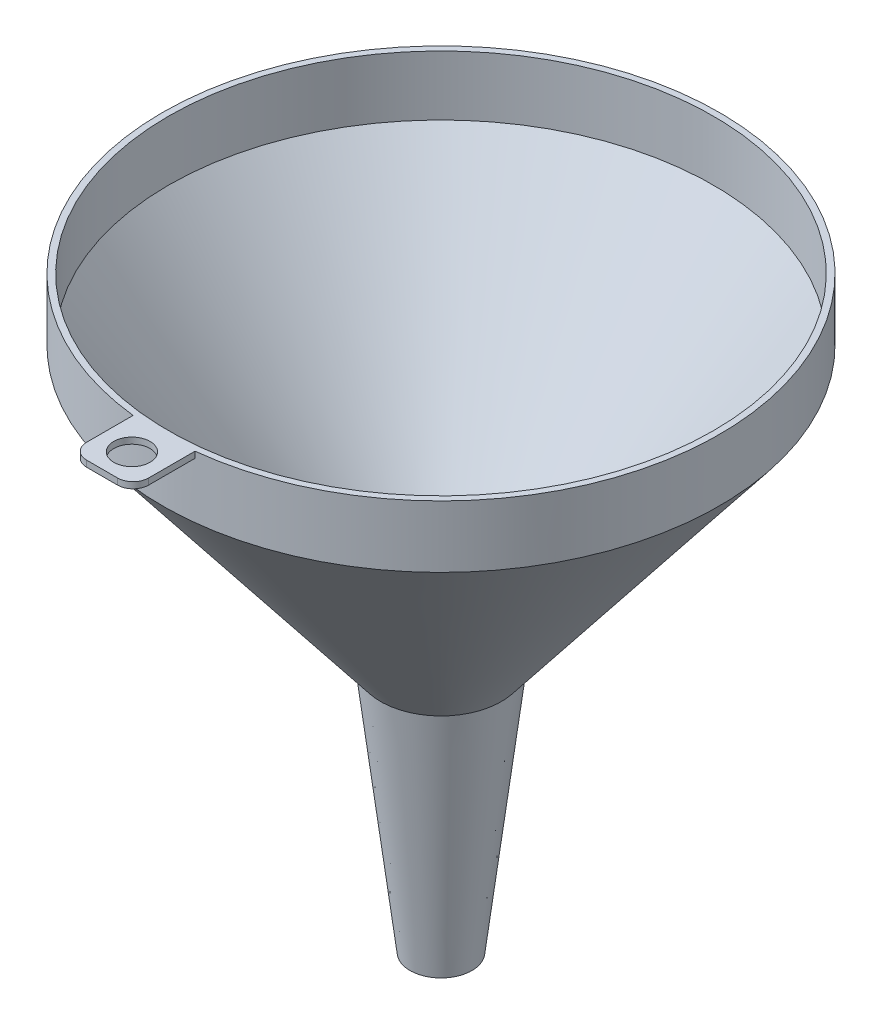
ISO-10303-21;
HEADER;
FILE_DESCRIPTION(('STEP AP214'),'2;1');
FILE_NAME('part.step','',(''),(''),'','','');
FILE_SCHEMA(('AUTOMOTIVE_DESIGN { 1 0 10303 214 1 1 1 1 }'));
ENDSEC;
DATA;
#1=APPLICATION_CONTEXT('core data for automotive mechanical design processes');
#2=APPLICATION_PROTOCOL_DEFINITION('international standard','automotive_design',2000,#1);
#3=PRODUCT_CONTEXT('',#1,'mechanical');
#4=PRODUCT('Part','Part','',(#3));
#5=PRODUCT_RELATED_PRODUCT_CATEGORY('part','',(#4));
#6=PRODUCT_DEFINITION_FORMATION('','',#4);
#7=PRODUCT_DEFINITION_CONTEXT('part definition',#1,'design');
#8=PRODUCT_DEFINITION('design','',#6,#7);
#9=PRODUCT_DEFINITION_SHAPE('','',#8);
#10=(LENGTH_UNIT() NAMED_UNIT(*) SI_UNIT(.MILLI.,.METRE.));
#11=(NAMED_UNIT(*) PLANE_ANGLE_UNIT() SI_UNIT($,.RADIAN.));
#12=(NAMED_UNIT(*) SI_UNIT($,.STERADIAN.) SOLID_ANGLE_UNIT());
#13=UNCERTAINTY_MEASURE_WITH_UNIT(LENGTH_MEASURE(1.E-05),#10,'distance_accuracy_value','');
#14=(GEOMETRIC_REPRESENTATION_CONTEXT(3) GLOBAL_UNCERTAINTY_ASSIGNED_CONTEXT((#13)) GLOBAL_UNIT_ASSIGNED_CONTEXT((#10,
#11,#12)) REPRESENTATION_CONTEXT('',''));
#15=CARTESIAN_POINT('',(0.,0.,0.));
#16=DIRECTION('',(0.,0.,1.));
#17=DIRECTION('',(1.,0.,0.));
#18=AXIS2_PLACEMENT_3D('',#15,#16,#17);
#19=CARTESIAN_POINT('',(0.,95.,0.));
#20=DIRECTION('',(0.,1.,0.));
#21=DIRECTION('',(-1.,0.,0.));
#22=AXIS2_PLACEMENT_3D('',#19,#20,#21);
#23=CYLINDRICAL_SURFACE('',#22,90.);
#24=CARTESIAN_POINT('',(0.,75.,0.));
#25=DIRECTION('',(0.,1.,0.));
#26=DIRECTION('',(-1.,0.,0.));
#27=AXIS2_PLACEMENT_3D('',#24,#25,#26);
#28=CIRCLE('',#27,90.);
#29=CARTESIAN_POINT('',(-90.,75.,0.));
#30=VERTEX_POINT('',#29);
#31=EDGE_CURVE('E137',#30,#30,#28,.T.);
#32=ORIENTED_EDGE('',*,*,#31,.T.);
#33=EDGE_LOOP('',(#32));
#34=FACE_BOUND('',#33,.T.);
#35=DIRECTION('',(0.,1.,0.));
#36=VECTOR('',#35,1.);
#37=CARTESIAN_POINT('',(10.,93.,89.4427190999916));
#38=LINE('',#37,#36);
#39=CARTESIAN_POINT('',(10.,93.,89.4427190999916));
#40=VERTEX_POINT('',#39);
#41=CARTESIAN_POINT('',(10.,95.,89.4427190999916));
#42=VERTEX_POINT('',#41);
#43=EDGE_CURVE('E100',#40,#42,#38,.T.);
#44=ORIENTED_EDGE('',*,*,#43,.F.);
#45=CARTESIAN_POINT('',(0.,93.,0.));
#46=DIRECTION('',(0.,1.,0.));
#47=DIRECTION('',(0.,0.,1.));
#48=AXIS2_PLACEMENT_3D('',#45,#46,#47);
#49=CIRCLE('',#48,90.);
#50=CARTESIAN_POINT('',(-9.99999999999999,93.,89.4427190999916));
#51=VERTEX_POINT('',#50);
#52=EDGE_CURVE('E105',#51,#40,#49,.T.);
#53=ORIENTED_EDGE('',*,*,#52,.F.);
#54=DIRECTION('',(0.,1.,0.));
#55=VECTOR('',#54,1.);
#56=CARTESIAN_POINT('',(-9.99999999999999,93.,89.4427190999916));
#57=LINE('',#56,#55);
#58=CARTESIAN_POINT('',(-9.99999999999999,95.,89.4427190999916));
#59=VERTEX_POINT('',#58);
#60=EDGE_CURVE('E90',#51,#59,#57,.T.);
#61=ORIENTED_EDGE('',*,*,#60,.T.);
#62=CARTESIAN_POINT('',(0.,95.,0.));
#63=DIRECTION('',(0.,1.,0.));
#64=DIRECTION('',(-1.,0.,0.));
#65=AXIS2_PLACEMENT_3D('',#62,#63,#64);
#66=CIRCLE('',#65,90.);
#67=EDGE_CURVE('E133',#42,#59,#66,.T.);
#68=ORIENTED_EDGE('',*,*,#67,.F.);
#69=EDGE_LOOP('',(#44,#53,#61,#68));
#70=FACE_BOUND('',#69,.T.);
#71=ADVANCED_FACE('F35',(#34,#70),#23,.T.);
#72=CARTESIAN_POINT('',(90.,95.,0.));
#73=DIRECTION('',(0.,-1.,0.));
#74=DIRECTION('',(1.,0.,0.));
#75=AXIS2_PLACEMENT_3D('',#72,#73,#74);
#76=PLANE('',#75);
#77=CARTESIAN_POINT('',(0.,95.,99.8177716526955));
#78=DIRECTION('',(0.,1.,0.));
#79=DIRECTION('',(-1.,0.,0.));
#80=AXIS2_PLACEMENT_3D('',#77,#78,#79);
#81=CIRCLE('',#80,5.85561005719157);
#82=CARTESIAN_POINT('',(-5.85561005719155,95.,99.8177716526955));
#83=VERTEX_POINT('',#82);
#84=EDGE_CURVE('E114',#83,#83,#81,.T.);
#85=ORIENTED_EDGE('',*,*,#84,.F.);
#86=EDGE_LOOP('',(#85));
#87=FACE_BOUND('',#86,.T.);
#88=CARTESIAN_POINT('',(0.,95.,0.));
#89=DIRECTION('',(0.,-1.,0.));
#90=DIRECTION('',(1.,0.,0.));
#91=AXIS2_PLACEMENT_3D('',#88,#89,#90);
#92=CIRCLE('',#91,88.);
#93=CARTESIAN_POINT('',(88.,95.,0.));
#94=VERTEX_POINT('',#93);
#95=EDGE_CURVE('E122',#94,#94,#92,.F.);
#96=ORIENTED_EDGE('',*,*,#95,.F.);
#97=EDGE_LOOP('',(#96));
#98=FACE_BOUND('',#97,.T.);
#99=DIRECTION('',(-1.,0.,0.));
#100=VECTOR('',#99,1.);
#101=CARTESIAN_POINT('',(0.,95.,109.442719099992));
#102=LINE('',#101,#100);
#103=CARTESIAN_POINT('',(5.00000000000001,95.,109.442719099992));
#104=VERTEX_POINT('',#103);
#105=CARTESIAN_POINT('',(-4.99999999999999,95.,109.442719099992));
#106=VERTEX_POINT('',#105);
#107=EDGE_CURVE('E111',#104,#106,#102,.T.);
#108=ORIENTED_EDGE('',*,*,#107,.F.);
#109=CARTESIAN_POINT('',(5.00000000000001,95.,104.442719099992));
#110=DIRECTION('',(0.,-1.,0.));
#111=DIRECTION('',(1.,0.,0.));
#112=AXIS2_PLACEMENT_3D('',#109,#110,#111);
#113=CIRCLE('',#112,5.);
#114=CARTESIAN_POINT('',(10.,95.,104.442719099992));
#115=VERTEX_POINT('',#114);
#116=EDGE_CURVE('E155',#104,#115,#113,.F.);
#117=ORIENTED_EDGE('',*,*,#116,.T.);
#118=DIRECTION('',(0.,0.,1.));
#119=VECTOR('',#118,1.);
#120=CARTESIAN_POINT('',(10.,95.,0.));
#121=LINE('',#120,#119);
#122=EDGE_CURVE('E109',#42,#115,#121,.T.);
#123=ORIENTED_EDGE('',*,*,#122,.F.);
#124=ORIENTED_EDGE('',*,*,#67,.T.);
#125=DIRECTION('',(0.,0.,1.));
#126=VECTOR('',#125,1.);
#127=CARTESIAN_POINT('',(-9.99999999999997,95.,0.));
#128=LINE('',#127,#126);
#129=CARTESIAN_POINT('',(-9.99999999999999,95.,104.442719099992));
#130=VERTEX_POINT('',#129);
#131=EDGE_CURVE('E95',#59,#130,#128,.T.);
#132=ORIENTED_EDGE('',*,*,#131,.T.);
#133=CARTESIAN_POINT('',(-4.99999999999999,95.,104.442719099992));
#134=DIRECTION('',(0.,-1.,0.));
#135=DIRECTION('',(1.,0.,0.));
#136=AXIS2_PLACEMENT_3D('',#133,#134,#135);
#137=CIRCLE('',#136,5.);
#138=EDGE_CURVE('E153',#130,#106,#137,.F.);
#139=ORIENTED_EDGE('',*,*,#138,.T.);
#140=EDGE_LOOP('',(#108,#117,#123,#124,#132,#139));
#141=FACE_BOUND('',#140,.T.);
#142=ADVANCED_FACE('F169',(#87,#98,#141),#76,.F.);
#143=CARTESIAN_POINT('',(0.,-95.,0.));
#144=DIRECTION('',(0.,1.,0.));
#145=DIRECTION('',(-1.,0.,0.));
#146=AXIS2_PLACEMENT_3D('',#143,#144,#145);
#147=PLANE('',#146);
#148=CARTESIAN_POINT('',(0.,-95.,0.));
#149=DIRECTION('',(0.,1.,0.));
#150=DIRECTION('',(-1.,0.,0.));
#151=AXIS2_PLACEMENT_3D('',#148,#149,#150);
#152=CIRCLE('',#151,7.9859201834812);
#153=CARTESIAN_POINT('',(-7.9859201834812,-95.,0.));
#154=VERTEX_POINT('',#153);
#155=EDGE_CURVE('E127',#154,#154,#152,.T.);
#156=ORIENTED_EDGE('',*,*,#155,.T.);
#157=EDGE_LOOP('',(#156));
#158=FACE_BOUND('',#157,.T.);
#159=CARTESIAN_POINT('',(0.,-95.,0.));
#160=DIRECTION('',(0.,1.,0.));
#161=DIRECTION('',(-1.,0.,0.));
#162=AXIS2_PLACEMENT_3D('',#159,#160,#161);
#163=CIRCLE('',#162,10.);
#164=CARTESIAN_POINT('',(-10.,-95.,0.));
#165=VERTEX_POINT('',#164);
#166=EDGE_CURVE('E143',#165,#165,#163,.T.);
#167=ORIENTED_EDGE('',*,*,#166,.F.);
#168=EDGE_LOOP('',(#167));
#169=FACE_BOUND('',#168,.T.);
#170=ADVANCED_FACE('F189',(#158,#169),#147,.F.);
#171=CARTESIAN_POINT('',(0.,-95.,0.));
#172=DIRECTION('',(0.,1.,0.));
#173=DIRECTION('',(-1.,0.,0.));
#174=AXIS2_PLACEMENT_3D('',#171,#172,#173);
#175=CONICAL_SURFACE('',#174,10.,0.118311914852847);
#176=CARTESIAN_POINT('',(0.,-15.,0.));
#177=DIRECTION('',(0.,1.,0.));
#178=DIRECTION('',(-1.,0.,0.));
#179=AXIS2_PLACEMENT_3D('',#176,#177,#178);
#180=CIRCLE('',#179,19.5093644211167);
#181=CARTESIAN_POINT('',(-19.5093644211167,-15.,0.));
#182=VERTEX_POINT('',#181);
#183=EDGE_CURVE('E140',#182,#182,#180,.T.);
#184=ORIENTED_EDGE('',*,*,#183,.F.);
#185=EDGE_LOOP('',(#184));
#186=FACE_BOUND('',#185,.T.);
#187=ORIENTED_EDGE('',*,*,#166,.T.);
#188=EDGE_LOOP('',(#187));
#189=FACE_BOUND('',#188,.T.);
#190=ADVANCED_FACE('F198',(#186,#189),#175,.T.);
#191=CARTESIAN_POINT('',(0.,-15.,0.));
#192=DIRECTION('',(0.,1.,0.));
#193=DIRECTION('',(-1.,0.,0.));
#194=AXIS2_PLACEMENT_3D('',#191,#192,#193);
#195=CONICAL_SURFACE('',#194,19.5093644211167,0.664430913681542);
#196=CARTESIAN_POINT('',(-90.,75.,0.));
#197=CARTESIAN_POINT('',(-89.2657225460533,74.0625,0.));
#198=CARTESIAN_POINT('',(-88.5314450921066,73.125,0.));
#199=CARTESIAN_POINT('',(-87.0628901842132,71.25,0.));
#200=CARTESIAN_POINT('',(-86.3286127302665,70.3125,0.));
#201=CARTESIAN_POINT('',(-84.8600578223731,68.4375,0.));
#202=CARTESIAN_POINT('',(-84.1257803684264,67.5,0.));
#203=CARTESIAN_POINT('',(-82.657225460533,65.625,0.));
#204=CARTESIAN_POINT('',(-81.9229480065863,64.6875,0.));
#205=CARTESIAN_POINT('',(-80.4543930986929,62.8125,0.));
#206=CARTESIAN_POINT('',(-79.7201156447462,61.875,0.));
#207=CARTESIAN_POINT('',(-78.2515607368528,60.,0.));
#208=CARTESIAN_POINT('',(-77.517283282906,59.0625,0.));
#209=CARTESIAN_POINT('',(-76.0487283750127,57.1875,0.));
#210=CARTESIAN_POINT('',(-75.314450921066,56.25,0.));
#211=CARTESIAN_POINT('',(-73.8458960131725,54.375,0.));
#212=CARTESIAN_POINT('',(-73.1116185592259,53.4375,0.));
#213=CARTESIAN_POINT('',(-71.6430636513325,51.5625,0.));
#214=CARTESIAN_POINT('',(-70.9087861973858,50.625,0.));
#215=CARTESIAN_POINT('',(-69.4402312894923,48.75,0.));
#216=CARTESIAN_POINT('',(-68.7059538355456,47.8125,0.));
#217=CARTESIAN_POINT('',(-67.2373989276522,45.9375,0.));
#218=CARTESIAN_POINT('',(-66.5031214737055,45.,0.));
#219=CARTESIAN_POINT('',(-65.0345665658121,43.125,0.));
#220=CARTESIAN_POINT('',(-64.3002891118654,42.1875,0.));
#221=CARTESIAN_POINT('',(-62.831734203972,40.3125,0.));
#222=CARTESIAN_POINT('',(-62.0974567500253,39.375,0.));
#223=CARTESIAN_POINT('',(-60.6289018421319,37.5,0.));
#224=CARTESIAN_POINT('',(-59.8946243881852,36.5625,0.));
#225=CARTESIAN_POINT('',(-58.4260694802918,34.6875,0.));
#226=CARTESIAN_POINT('',(-57.6917920263451,33.75,0.));
#227=CARTESIAN_POINT('',(-56.2232371184517,31.875,0.));
#228=CARTESIAN_POINT('',(-55.488959664505,30.9375,0.));
#229=CARTESIAN_POINT('',(-54.0204047566116,29.0625,0.));
#230=CARTESIAN_POINT('',(-53.2861273026649,28.125,0.));
#231=CARTESIAN_POINT('',(-51.8175723947715,26.25,0.));
#232=CARTESIAN_POINT('',(-51.0832949408248,25.3125,0.));
#233=CARTESIAN_POINT('',(-49.6147400329314,23.4375,0.));
#234=CARTESIAN_POINT('',(-48.8804625789847,22.5,0.));
#235=CARTESIAN_POINT('',(-47.4119076710913,20.625,0.));
#236=CARTESIAN_POINT('',(-46.6776302171446,19.6875,0.));
#237=CARTESIAN_POINT('',(-45.2090753092512,17.8125,0.));
#238=CARTESIAN_POINT('',(-44.4747978553045,16.875,0.));
#239=CARTESIAN_POINT('',(-43.0062429474111,15.,0.));
#240=CARTESIAN_POINT('',(-42.2719654934644,14.0625,0.));
#241=CARTESIAN_POINT('',(-40.803410585571,12.1875,0.));
#242=CARTESIAN_POINT('',(-40.0691331316243,11.25,0.));
#243=CARTESIAN_POINT('',(-38.6005782237309,9.37500000000001,0.));
#244=CARTESIAN_POINT('',(-37.8663007697842,8.4375,0.));
#245=CARTESIAN_POINT('',(-36.3977458618908,6.5625,0.));
#246=CARTESIAN_POINT('',(-35.6634684079441,5.625,0.));
#247=CARTESIAN_POINT('',(-34.1949135000507,3.75,0.));
#248=CARTESIAN_POINT('',(-33.460636046104,2.81250000000001,0.));
#249=CARTESIAN_POINT('',(-31.9920811382106,0.937500000000008,0.));
#250=CARTESIAN_POINT('',(-31.2578036842639,0.,0.));
#251=CARTESIAN_POINT('',(-29.7892487763705,-1.87499999999999,0.));
#252=CARTESIAN_POINT('',(-29.0549713224238,-2.8125,0.));
#253=CARTESIAN_POINT('',(-27.5864164145304,-4.6875,0.));
#254=CARTESIAN_POINT('',(-26.8521389605837,-5.625,0.));
#255=CARTESIAN_POINT('',(-25.3835840526903,-7.49999999999999,0.));
#256=CARTESIAN_POINT('',(-24.6493065987436,-8.43749999999999,0.));
#257=CARTESIAN_POINT('',(-23.1807516908502,-10.3125,0.));
#258=CARTESIAN_POINT('',(-22.4464742369035,-11.25,0.));
#259=CARTESIAN_POINT('',(-20.9779193290101,-13.125,0.));
#260=CARTESIAN_POINT('',(-20.2436418750634,-14.0625,0.));
#261=CARTESIAN_POINT('',(-19.5093644211167,-15.,0.));
#262=B_SPLINE_CURVE_WITH_KNOTS('',3,(#196,#197,#198,#199,#200,#201,#202,#203,#204,#205,#206,
#207,#208,#209,#210,#211,#212,#213,#214,#215,#216,#217,#218,#219,#220,#221,#222,#223,#224,#225,
#226,#227,#228,#229,#230,#231,#232,#233,#234,#235,#236,#237,#238,#239,#240,#241,#242,#243,#244,
#245,#246,#247,#248,#249,#250,#251,#252,#253,#254,#255,#256,#257,#258,#259,#260,#261),
.UNSPECIFIED.,.F.,.F.,(4,2,2,2,2,2,2,2,2,2,2,2,2,2,2,2,2,2,2,2,2,2,2,2,2,2,2,2,2,2,2,2,4),(0.,
3.57248186340673,7.14496372681347,10.7174455902202,14.2899274536269,17.8624093170337,
21.4348911804404,25.0073730438471,28.5798549072539,32.1523367706606,35.7248186340673,
39.2973004974741,42.8697823608808,46.4422642242875,50.0147460876943,53.587227951101,
57.1597098145077,60.7321916779145,64.3046735413212,67.877155404728,71.4496372681347,
75.0221191315414,78.5946009949482,82.1670828583549,85.7395647217616,89.3120465851683,
92.8845284485751,96.4570103119818,100.029492175389,103.601974038795,107.174455902202,
110.746937765609,114.319419629015),.UNSPECIFIED.);
#263=EDGE_CURVE('BSEAM194',#30,#182,#262,.T.);
#264=ORIENTED_EDGE('',*,*,#31,.F.);
#265=ORIENTED_EDGE('',*,*,#183,.T.);
#266=ORIENTED_EDGE('',*,*,#263,.T.);
#267=ORIENTED_EDGE('',*,*,#263,.F.);
#268=EDGE_LOOP('',(#264,#266,#265,#267));
#269=FACE_BOUND('',#268,.T.);
#270=ADVANCED_FACE('F194',(#269),#195,.T.);
#271=CARTESIAN_POINT('',(0.,-94.7639278159901,0.));
#272=DIRECTION('',(0.,1.,0.));
#273=DIRECTION('',(-1.,0.,0.));
#274=AXIS2_PLACEMENT_3D('',#271,#272,#273);
#275=CONICAL_SURFACE('',#274,8.01398138882418,0.118311914852847);
#276=CARTESIAN_POINT('',(0.,-14.2077338116771,0.));
#277=DIRECTION('',(0.,1.,0.));
#278=DIRECTION('',(-1.,0.,0.));
#279=AXIS2_PLACEMENT_3D('',#276,#277,#278);
#280=CIRCLE('',#279,17.589458953389);
#281=CARTESIAN_POINT('',(-17.589458953389,-14.2077338116771,0.));
#282=VERTEX_POINT('',#281);
#283=EDGE_CURVE('E124',#282,#282,#280,.T.);
#284=ORIENTED_EDGE('',*,*,#283,.T.);
#285=EDGE_LOOP('',(#284));
#286=FACE_BOUND('',#285,.T.);
#287=ORIENTED_EDGE('',*,*,#155,.F.);
#288=EDGE_LOOP('',(#287));
#289=FACE_BOUND('',#288,.T.);
#290=ADVANCED_FACE('F197',(#286,#289),#275,.F.);
#291=CARTESIAN_POINT('',(0.,-13.7667775814881,0.));
#292=DIRECTION('',(0.,1.,0.));
#293=DIRECTION('',(-1.,0.,0.));
#294=AXIS2_PLACEMENT_3D('',#291,#292,#293);
#295=CONICAL_SURFACE('',#294,17.9348287859278,0.664430913681542);
#296=CARTESIAN_POINT('',(0.,75.6900042659369,0.));
#297=DIRECTION('',(0.,1.,0.));
#298=DIRECTION('',(-1.,0.,0.));
#299=AXIS2_PLACEMENT_3D('',#296,#297,#298);
#300=CIRCLE('',#299,88.);
#301=CARTESIAN_POINT('',(-88.,75.6900042659369,0.));
#302=VERTEX_POINT('',#301);
#303=EDGE_CURVE('E128',#302,#302,#300,.T.);
#304=CARTESIAN_POINT('',(-88.,75.6900042659369,0.));
#305=CARTESIAN_POINT('',(-87.2665568640978,74.7535694942951,0.));
#306=CARTESIAN_POINT('',(-86.5331137281956,73.8171347226533,0.));
#307=CARTESIAN_POINT('',(-85.0662274563912,71.9442651793696,0.));
#308=CARTESIAN_POINT('',(-84.332784320489,71.0078304077278,0.));
#309=CARTESIAN_POINT('',(-82.8658980486846,69.1349608644442,0.));
#310=CARTESIAN_POINT('',(-82.1324549127824,68.1985260928024,0.));
#311=CARTESIAN_POINT('',(-80.665568640978,66.3256565495187,0.));
#312=CARTESIAN_POINT('',(-79.9321255050758,65.3892217778769,0.));
#313=CARTESIAN_POINT('',(-78.4652392332714,63.5163522345933,0.));
#314=CARTESIAN_POINT('',(-77.7317960973692,62.5799174629515,0.));
#315=CARTESIAN_POINT('',(-76.2649098255648,60.7070479196679,0.));
#316=CARTESIAN_POINT('',(-75.5314666896626,59.7706131480261,0.));
#317=CARTESIAN_POINT('',(-74.0645804178582,57.8977436047424,0.));
#318=CARTESIAN_POINT('',(-73.331137281956,56.9613088331006,0.));
#319=CARTESIAN_POINT('',(-71.8642510101516,55.088439289817,0.));
#320=CARTESIAN_POINT('',(-71.1308078742494,54.1520045181752,0.));
#321=CARTESIAN_POINT('',(-69.663921602445,52.2791349748916,0.));
#322=CARTESIAN_POINT('',(-68.9304784665428,51.3427002032498,0.));
#323=CARTESIAN_POINT('',(-67.4635921947384,49.4698306599661,0.));
#324=CARTESIAN_POINT('',(-66.7301490588362,48.5333958883243,0.));
#325=CARTESIAN_POINT('',(-65.2632627870319,46.6605263450407,0.));
#326=CARTESIAN_POINT('',(-64.5298196511297,45.7240915733989,0.));
#327=CARTESIAN_POINT('',(-63.0629333793253,43.8512220301153,0.));
#328=CARTESIAN_POINT('',(-62.3294902434231,42.9147872584734,0.));
#329=CARTESIAN_POINT('',(-60.8626039716187,41.0419177151898,0.));
#330=CARTESIAN_POINT('',(-60.1291608357165,40.105482943548,0.));
#331=CARTESIAN_POINT('',(-58.6622745639121,38.2326134002644,0.));
#332=CARTESIAN_POINT('',(-57.9288314280099,37.2961786286226,0.));
#333=CARTESIAN_POINT('',(-56.4619451562055,35.4233090853389,0.));
#334=CARTESIAN_POINT('',(-55.7285020203033,34.4868743136971,0.));
#335=CARTESIAN_POINT('',(-54.2616157484989,32.6140047704135,0.));
#336=CARTESIAN_POINT('',(-53.5281726125967,31.6775699987717,0.));
#337=CARTESIAN_POINT('',(-52.0612863407923,29.8047004554881,0.));
#338=CARTESIAN_POINT('',(-51.3278432048901,28.8682656838463,0.));
#339=CARTESIAN_POINT('',(-49.8609569330857,26.9953961405626,0.));
#340=CARTESIAN_POINT('',(-49.1275137971835,26.0589613689208,0.));
#341=CARTESIAN_POINT('',(-47.6606275253791,24.1860918256372,0.));
#342=CARTESIAN_POINT('',(-46.9271843894769,23.2496570539954,0.));
#343=CARTESIAN_POINT('',(-45.4602981176725,21.3767875107118,0.));
#344=CARTESIAN_POINT('',(-44.7268549817703,20.44035273907,0.));
#345=CARTESIAN_POINT('',(-43.2599687099659,18.5674831957863,0.));
#346=CARTESIAN_POINT('',(-42.5265255740637,17.6310484241445,0.));
#347=CARTESIAN_POINT('',(-41.0596393022593,15.7581788808609,0.));
#348=CARTESIAN_POINT('',(-40.3261961663571,14.8217441092191,0.));
#349=CARTESIAN_POINT('',(-38.8593098945527,12.9488745659354,0.));
#350=CARTESIAN_POINT('',(-38.1258667586506,12.0124397942936,0.));
#351=CARTESIAN_POINT('',(-36.6589804868462,10.13957025101,0.));
#352=CARTESIAN_POINT('',(-35.925537350944,9.2031354793682,0.));
#353=CARTESIAN_POINT('',(-34.4586510791396,7.33026593608458,0.));
#354=CARTESIAN_POINT('',(-33.7252079432374,6.39383116444277,0.));
#355=CARTESIAN_POINT('',(-32.258321671433,4.52096162115914,0.));
#356=CARTESIAN_POINT('',(-31.5248785355308,3.58452684951733,0.));
#357=CARTESIAN_POINT('',(-30.0579922637264,1.7116573062337,0.));
#358=CARTESIAN_POINT('',(-29.3245491278242,0.775222534591889,0.));
#359=CARTESIAN_POINT('',(-27.8576628560198,-1.09764700869173,0.));
#360=CARTESIAN_POINT('',(-27.1242197201176,-2.03408178033354,0.));
#361=CARTESIAN_POINT('',(-25.6573334483132,-3.90695132361717,0.));
#362=CARTESIAN_POINT('',(-24.923890312411,-4.84338609525898,0.));
#363=CARTESIAN_POINT('',(-23.4570040406066,-6.71625563854261,0.));
#364=CARTESIAN_POINT('',(-22.7235609047044,-7.65269041018442,0.));
#365=CARTESIAN_POINT('',(-21.2566746329,-9.52555995346805,0.));
#366=CARTESIAN_POINT('',(-20.5232314969978,-10.4619947251099,0.));
#367=CARTESIAN_POINT('',(-19.0563452251934,-12.3348642683935,0.));
#368=CARTESIAN_POINT('',(-18.3229020892912,-13.2712990400353,0.));
#369=CARTESIAN_POINT('',(-17.589458953389,-14.2077338116771,0.));
#370=B_SPLINE_CURVE_WITH_KNOTS('',3,(#304,#305,#306,#307,#308,#309,#310,#311,#312,#313,#314,
#315,#316,#317,#318,#319,#320,#321,#322,#323,#324,#325,#326,#327,#328,#329,#330,#331,#332,#333,
#334,#335,#336,#337,#338,#339,#340,#341,#342,#343,#344,#345,#346,#347,#348,#349,#350,#351,#352,
#353,#354,#355,#356,#357,#358,#359,#360,#361,#362,#363,#364,#365,#366,#367,#368,#369),
.UNSPECIFIED.,.F.,.F.,(4,2,2,2,2,2,2,2,2,2,2,2,2,2,2,2,2,2,2,2,2,2,2,2,2,2,2,2,2,2,2,2,4),(0.,
3.56842265381738,7.13684530763477,10.7052679614522,14.2736906152695,17.8421132690869,
21.4105359229043,24.9789585767217,28.5473812305391,32.1158038843565,35.6842265381739,
39.2526491919913,42.8210718458086,46.389494499626,49.9579171534434,53.5263398072608,
57.0947624610782,60.6631851148956,64.231607768713,67.8000304225304,71.3684530763477,
74.9368757301651,78.5052983839825,82.0737210377999,85.6421436916173,89.2105663454347,
92.7789889992521,96.3474116530694,99.9158343068868,103.484256960704,107.052679614522,
110.621102268339,114.189524922156),.UNSPECIFIED.);
#371=EDGE_CURVE('BSEAM179',#302,#282,#370,.T.);
#372=ORIENTED_EDGE('',*,*,#303,.T.);
#373=ORIENTED_EDGE('',*,*,#283,.F.);
#374=ORIENTED_EDGE('',*,*,#371,.T.);
#375=ORIENTED_EDGE('',*,*,#371,.F.);
#376=EDGE_LOOP('',(#372,#374,#373,#375));
#377=FACE_BOUND('',#376,.T.);
#378=ADVANCED_FACE('F179',(#377),#295,.F.);
#379=CARTESIAN_POINT('',(0.,95.,0.));
#380=DIRECTION('',(0.,1.,0.));
#381=DIRECTION('',(-1.,0.,0.));
#382=AXIS2_PLACEMENT_3D('',#379,#380,#381);
#383=CYLINDRICAL_SURFACE('',#382,88.);
#384=ORIENTED_EDGE('',*,*,#95,.T.);
#385=EDGE_LOOP('',(#384));
#386=FACE_BOUND('',#385,.T.);
#387=ORIENTED_EDGE('',*,*,#303,.F.);
#388=EDGE_LOOP('',(#387));
#389=FACE_BOUND('',#388,.T.);
#390=ADVANCED_FACE('F172',(#386,#389),#383,.F.);
#391=CARTESIAN_POINT('',(10.,93.,0.));
#392=DIRECTION('',(-1.,0.,0.));
#393=DIRECTION('',(0.,0.,1.));
#394=AXIS2_PLACEMENT_3D('',#391,#392,#393);
#395=PLANE('',#394);
#396=ORIENTED_EDGE('',*,*,#122,.T.);
#397=DIRECTION('',(0.,1.,0.));
#398=VECTOR('',#397,1.);
#399=CARTESIAN_POINT('',(10.,93.,104.442719099992));
#400=LINE('',#399,#398);
#401=CARTESIAN_POINT('',(10.,93.,104.442719099992));
#402=VERTEX_POINT('',#401);
#403=EDGE_CURVE('E58',#115,#402,#400,.F.);
#404=ORIENTED_EDGE('',*,*,#403,.T.);
#405=DIRECTION('',(0.,0.,1.));
#406=VECTOR('',#405,1.);
#407=CARTESIAN_POINT('',(10.,93.,0.));
#408=LINE('',#407,#406);
#409=EDGE_CURVE('E101',#40,#402,#408,.T.);
#410=ORIENTED_EDGE('',*,*,#409,.F.);
#411=ORIENTED_EDGE('',*,*,#43,.T.);
#412=EDGE_LOOP('',(#396,#404,#410,#411));
#413=FACE_BOUND('',#412,.T.);
#414=ADVANCED_FACE('F170',(#413),#395,.F.);
#415=CARTESIAN_POINT('',(0.,93.,109.442719099992));
#416=DIRECTION('',(0.,0.,-1.));
#417=DIRECTION('',(-1.,0.,0.));
#418=AXIS2_PLACEMENT_3D('',#415,#416,#417);
#419=PLANE('',#418);
#420=DIRECTION('',(-1.,0.,0.));
#421=VECTOR('',#420,1.);
#422=CARTESIAN_POINT('',(0.,93.,109.442719099992));
#423=LINE('',#422,#421);
#424=CARTESIAN_POINT('',(5.00000000000001,93.,109.442719099992));
#425=VERTEX_POINT('',#424);
#426=CARTESIAN_POINT('',(-4.99999999999999,93.,109.442719099992));
#427=VERTEX_POINT('',#426);
#428=EDGE_CURVE('E107',#425,#427,#423,.T.);
#429=ORIENTED_EDGE('',*,*,#428,.F.);
#430=DIRECTION('',(0.,1.,0.));
#431=VECTOR('',#430,1.);
#432=CARTESIAN_POINT('',(5.00000000000001,93.,109.442719099992));
#433=LINE('',#432,#431);
#434=EDGE_CURVE('E150',#425,#104,#433,.T.);
#435=ORIENTED_EDGE('',*,*,#434,.T.);
#436=ORIENTED_EDGE('',*,*,#107,.T.);
#437=DIRECTION('',(0.,1.,0.));
#438=VECTOR('',#437,1.);
#439=CARTESIAN_POINT('',(-4.99999999999999,93.,109.442719099992));
#440=LINE('',#439,#438);
#441=EDGE_CURVE('E146',#106,#427,#440,.F.);
#442=ORIENTED_EDGE('',*,*,#441,.T.);
#443=EDGE_LOOP('',(#429,#435,#436,#442));
#444=FACE_BOUND('',#443,.T.);
#445=ADVANCED_FACE('F163',(#444),#419,.F.);
#446=CARTESIAN_POINT('',(-9.99999999999997,93.,0.));
#447=DIRECTION('',(-1.,0.,0.));
#448=DIRECTION('',(0.,0.,1.));
#449=AXIS2_PLACEMENT_3D('',#446,#447,#448);
#450=PLANE('',#449);
#451=DIRECTION('',(0.,0.,1.));
#452=VECTOR('',#451,1.);
#453=CARTESIAN_POINT('',(-9.99999999999997,93.,0.));
#454=LINE('',#453,#452);
#455=CARTESIAN_POINT('',(-9.99999999999999,93.,104.442719099992));
#456=VERTEX_POINT('',#455);
#457=EDGE_CURVE('E92',#51,#456,#454,.T.);
#458=ORIENTED_EDGE('',*,*,#457,.T.);
#459=DIRECTION('',(0.,1.,0.));
#460=VECTOR('',#459,1.);
#461=CARTESIAN_POINT('',(-9.99999999999999,95.,104.442719099992));
#462=LINE('',#461,#460);
#463=EDGE_CURVE('E11',#456,#130,#462,.T.);
#464=ORIENTED_EDGE('',*,*,#463,.T.);
#465=ORIENTED_EDGE('',*,*,#131,.F.);
#466=ORIENTED_EDGE('',*,*,#60,.F.);
#467=EDGE_LOOP('',(#458,#464,#465,#466));
#468=FACE_BOUND('',#467,.T.);
#469=ADVANCED_FACE('F91',(#468),#450,.T.);
#470=CARTESIAN_POINT('',(0.,93.,0.));
#471=DIRECTION('',(0.,1.,0.));
#472=DIRECTION('',(0.,0.,1.));
#473=AXIS2_PLACEMENT_3D('',#470,#471,#472);
#474=PLANE('',#473);
#475=CARTESIAN_POINT('',(0.,93.,99.8177716526955));
#476=DIRECTION('',(0.,1.,0.));
#477=DIRECTION('',(0.,0.,1.));
#478=AXIS2_PLACEMENT_3D('',#475,#476,#477);
#479=CIRCLE('',#478,5.85561005719157);
#480=CARTESIAN_POINT('',(0.,93.,105.673381709887));
#481=VERTEX_POINT('',#480);
#482=EDGE_CURVE('E119',#481,#481,#479,.T.);
#483=ORIENTED_EDGE('',*,*,#482,.T.);
#484=EDGE_LOOP('',(#483));
#485=FACE_BOUND('',#484,.T.);
#486=ORIENTED_EDGE('',*,*,#409,.T.);
#487=CARTESIAN_POINT('',(5.00000000000001,93.,104.442719099992));
#488=DIRECTION('',(0.,1.,0.));
#489=DIRECTION('',(0.,0.,1.));
#490=AXIS2_PLACEMENT_3D('',#487,#488,#489);
#491=CIRCLE('',#490,5.);
#492=EDGE_CURVE('E43',#402,#425,#491,.F.);
#493=ORIENTED_EDGE('',*,*,#492,.T.);
#494=ORIENTED_EDGE('',*,*,#428,.T.);
#495=CARTESIAN_POINT('',(-4.99999999999999,93.,104.442719099992));
#496=DIRECTION('',(0.,1.,0.));
#497=DIRECTION('',(0.,0.,1.));
#498=AXIS2_PLACEMENT_3D('',#495,#496,#497);
#499=CIRCLE('',#498,5.);
#500=EDGE_CURVE('E50',#427,#456,#499,.F.);
#501=ORIENTED_EDGE('',*,*,#500,.T.);
#502=ORIENTED_EDGE('',*,*,#457,.F.);
#503=ORIENTED_EDGE('',*,*,#52,.T.);
#504=EDGE_LOOP('',(#486,#493,#494,#501,#502,#503));
#505=FACE_BOUND('',#504,.T.);
#506=ADVANCED_FACE('F104',(#485,#505),#474,.F.);
#507=CARTESIAN_POINT('',(0.,73.,99.8177716526955));
#508=DIRECTION('',(0.,1.,0.));
#509=DIRECTION('',(-1.,0.,0.));
#510=AXIS2_PLACEMENT_3D('',#507,#508,#509);
#511=CYLINDRICAL_SURFACE('',#510,5.85561005719157);
#512=ORIENTED_EDGE('',*,*,#84,.T.);
#513=EDGE_LOOP('',(#512));
#514=FACE_BOUND('',#513,.T.);
#515=ORIENTED_EDGE('',*,*,#482,.F.);
#516=EDGE_LOOP('',(#515));
#517=FACE_BOUND('',#516,.T.);
#518=ADVANCED_FACE('F206',(#514,#517),#511,.F.);
#519=CARTESIAN_POINT('',(5.00000000000001,93.,104.442719099992));
#520=DIRECTION('',(0.,1.,0.));
#521=DIRECTION('',(-1.,0.,0.));
#522=AXIS2_PLACEMENT_3D('',#519,#520,#521);
#523=CYLINDRICAL_SURFACE('',#522,5.);
#524=ORIENTED_EDGE('',*,*,#492,.F.);
#525=ORIENTED_EDGE('',*,*,#403,.F.);
#526=ORIENTED_EDGE('',*,*,#116,.F.);
#527=ORIENTED_EDGE('',*,*,#434,.F.);
#528=EDGE_LOOP('',(#524,#525,#526,#527));
#529=FACE_BOUND('',#528,.T.);
#530=ADVANCED_FACE('F166',(#529),#523,.T.);
#531=CARTESIAN_POINT('',(-4.99999999999999,93.,104.442719099992));
#532=DIRECTION('',(0.,-1.,0.));
#533=DIRECTION('',(1.,0.,0.));
#534=AXIS2_PLACEMENT_3D('',#531,#532,#533);
#535=CYLINDRICAL_SURFACE('',#534,5.);
#536=ORIENTED_EDGE('',*,*,#500,.F.);
#537=ORIENTED_EDGE('',*,*,#441,.F.);
#538=ORIENTED_EDGE('',*,*,#138,.F.);
#539=ORIENTED_EDGE('',*,*,#463,.F.);
#540=EDGE_LOOP('',(#536,#537,#538,#539));
#541=FACE_BOUND('',#540,.T.);
#542=ADVANCED_FACE('F37',(#541),#535,.T.);
#543=CLOSED_SHELL('',(#71,#142,#170,#190,#270,#290,#378,#390,#414,#445,#469,#506,#518,#530,#542));
#544=MANIFOLD_SOLID_BREP('B2',#543);
#545=ADVANCED_BREP_SHAPE_REPRESENTATION('',(#18,#544),#14);
#546=SHAPE_DEFINITION_REPRESENTATION(#9,#545);
ENDSEC;
END-ISO-10303-21;
